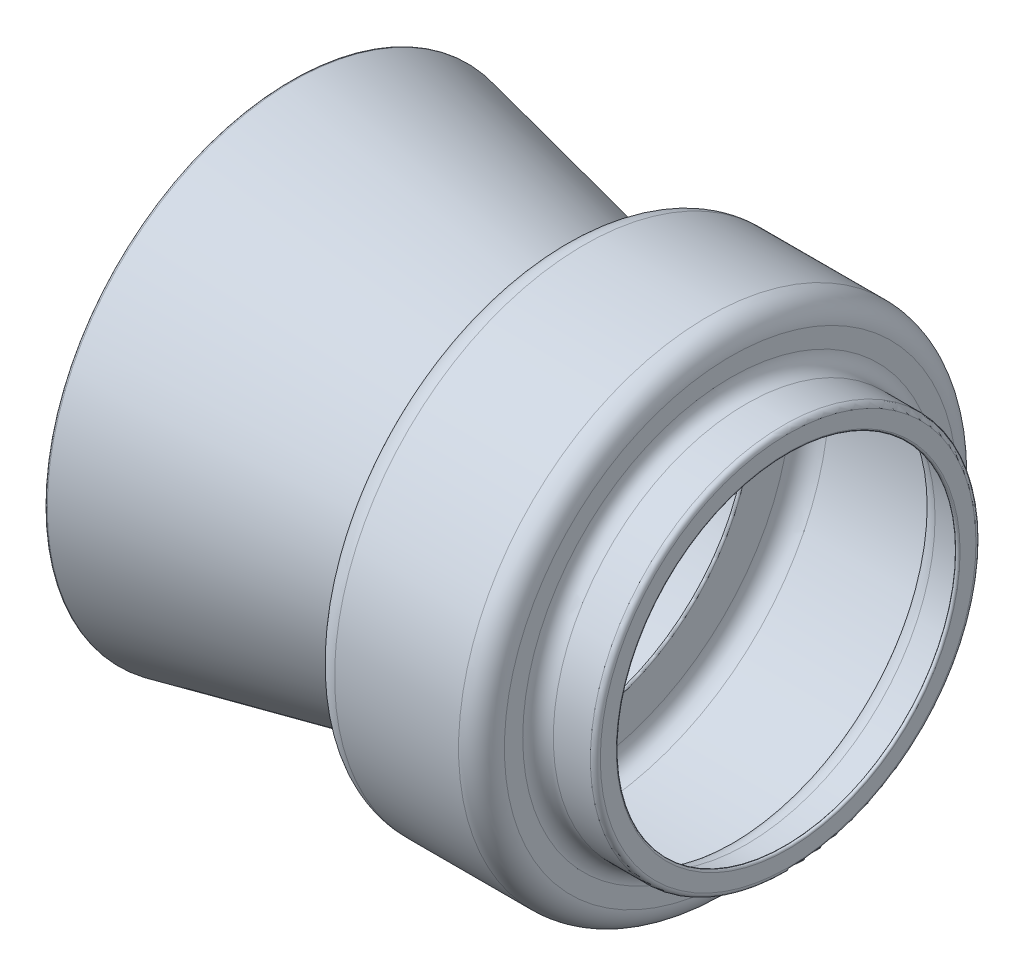
ISO-10303-21;
HEADER;
FILE_DESCRIPTION(('STEP AP214'),'2;1');
FILE_NAME('part.step','',(''),(''),'','','');
FILE_SCHEMA(('AUTOMOTIVE_DESIGN { 1 0 10303 214 1 1 1 1 }'));
ENDSEC;
DATA;
#1=APPLICATION_CONTEXT('core data for automotive mechanical design processes');
#2=APPLICATION_PROTOCOL_DEFINITION('international standard','automotive_design',2000,#1);
#3=PRODUCT_CONTEXT('',#1,'mechanical');
#4=PRODUCT('Part','Part','',(#3));
#5=PRODUCT_RELATED_PRODUCT_CATEGORY('part','',(#4));
#6=PRODUCT_DEFINITION_FORMATION('','',#4);
#7=PRODUCT_DEFINITION_CONTEXT('part definition',#1,'design');
#8=PRODUCT_DEFINITION('design','',#6,#7);
#9=PRODUCT_DEFINITION_SHAPE('','',#8);
#10=(LENGTH_UNIT() NAMED_UNIT(*) SI_UNIT(.MILLI.,.METRE.));
#11=(NAMED_UNIT(*) PLANE_ANGLE_UNIT() SI_UNIT($,.RADIAN.));
#12=(NAMED_UNIT(*) SI_UNIT($,.STERADIAN.) SOLID_ANGLE_UNIT());
#13=UNCERTAINTY_MEASURE_WITH_UNIT(LENGTH_MEASURE(1.E-05),#10,'distance_accuracy_value','');
#14=(GEOMETRIC_REPRESENTATION_CONTEXT(3) GLOBAL_UNCERTAINTY_ASSIGNED_CONTEXT((#13)) GLOBAL_UNIT_ASSIGNED_CONTEXT((#10,
#11,#12)) REPRESENTATION_CONTEXT('',''));
#15=CARTESIAN_POINT('',(0.,0.,0.));
#16=DIRECTION('',(0.,0.,1.));
#17=DIRECTION('',(1.,0.,0.));
#18=AXIS2_PLACEMENT_3D('',#15,#16,#17);
#19=CARTESIAN_POINT('',(403.522825001887,1.50496034846484E-13,7.14780592607678E-13));
#20=DIRECTION('',(1.,0.,0.));
#21=DIRECTION('',(0.,0.,-1.));
#22=AXIS2_PLACEMENT_3D('',#19,#20,#21);
#23=TOROIDAL_SURFACE('',#22,337.5,3.75000000000005);
#24=CARTESIAN_POINT('',(407.272825001887,1.50496034846484E-13,7.14780592607678E-13));
#25=DIRECTION('',(1.,0.,0.));
#26=DIRECTION('',(0.,0.,-1.));
#27=AXIS2_PLACEMENT_3D('',#24,#25,#26);
#28=CIRCLE('',#27,337.5);
#29=CARTESIAN_POINT('',(407.272825001887,1.50496034846484E-13,-337.499999999999));
#30=VERTEX_POINT('',#29);
#31=EDGE_CURVE('E10',#30,#30,#28,.T.);
#32=ORIENTED_EDGE('',*,*,#31,.T.);
#33=EDGE_LOOP('',(#32));
#34=FACE_BOUND('',#33,.T.);
#35=CARTESIAN_POINT('',(399.772825001887,1.50496034846484E-13,7.14780592607678E-13));
#36=DIRECTION('',(1.,0.,0.));
#37=DIRECTION('',(0.,0.,-1.));
#38=AXIS2_PLACEMENT_3D('',#35,#36,#37);
#39=CIRCLE('',#38,337.5);
#40=CARTESIAN_POINT('',(399.772825001887,1.50496034846484E-13,-337.499999999999));
#41=VERTEX_POINT('',#40);
#42=EDGE_CURVE('E105',#41,#41,#39,.T.);
#43=ORIENTED_EDGE('',*,*,#42,.F.);
#44=EDGE_LOOP('',(#43));
#45=FACE_BOUND('',#44,.T.);
#46=ADVANCED_FACE('F32',(#34,#45),#23,.T.);
#47=CARTESIAN_POINT('',(407.272825001887,337.5,7.14780592607678E-13));
#48=DIRECTION('',(1.,0.,0.));
#49=DIRECTION('',(0.,0.,-1.));
#50=AXIS2_PLACEMENT_3D('',#47,#48,#49);
#51=PLANE('',#50);
#52=CARTESIAN_POINT('',(407.272825001887,1.50496034846484E-13,7.14780592607678E-13));
#53=DIRECTION('',(1.,0.,0.));
#54=DIRECTION('',(0.,0.,-1.));
#55=AXIS2_PLACEMENT_3D('',#52,#53,#54);
#56=CIRCLE('',#55,368.625);
#57=CARTESIAN_POINT('',(407.272825001887,1.50496034846484E-13,-368.624999999999));
#58=VERTEX_POINT('',#57);
#59=EDGE_CURVE('E38',#58,#58,#56,.T.);
#60=ORIENTED_EDGE('',*,*,#59,.T.);
#61=EDGE_LOOP('',(#60));
#62=FACE_BOUND('',#61,.T.);
#63=ORIENTED_EDGE('',*,*,#31,.F.);
#64=EDGE_LOOP('',(#63));
#65=FACE_BOUND('',#64,.T.);
#66=ADVANCED_FACE('F113',(#62,#65),#51,.T.);
#67=CARTESIAN_POINT('',(397.522825001887,1.50496034846484E-13,7.14780592607678E-13));
#68=DIRECTION('',(1.,0.,0.));
#69=DIRECTION('',(0.,0.,-1.));
#70=AXIS2_PLACEMENT_3D('',#67,#68,#69);
#71=TOROIDAL_SURFACE('',#70,368.625,9.75000000000001);
#72=CARTESIAN_POINT('',(397.522825001887,1.50496034846484E-13,7.14780592607678E-13));
#73=DIRECTION('',(1.,0.,0.));
#74=DIRECTION('',(0.,0.,-1.));
#75=AXIS2_PLACEMENT_3D('',#72,#73,#74);
#76=CIRCLE('',#75,378.375);
#77=CARTESIAN_POINT('',(397.522825001887,1.50496034846484E-13,-378.374999999999));
#78=VERTEX_POINT('',#77);
#79=EDGE_CURVE('E42',#78,#78,#76,.T.);
#80=ORIENTED_EDGE('',*,*,#79,.T.);
#81=EDGE_LOOP('',(#80));
#82=FACE_BOUND('',#81,.T.);
#83=ORIENTED_EDGE('',*,*,#59,.F.);
#84=EDGE_LOOP('',(#83));
#85=FACE_BOUND('',#84,.T.);
#86=ADVANCED_FACE('F117',(#82,#85),#71,.T.);
#87=CARTESIAN_POINT('',(407.272825001887,1.50496034846484E-13,7.14780592607678E-13));
#88=DIRECTION('',(1.,0.,0.));
#89=DIRECTION('',(0.,0.,-1.));
#90=AXIS2_PLACEMENT_3D('',#87,#88,#89);
#91=CYLINDRICAL_SURFACE('',#90,378.375);
#92=CARTESIAN_POINT('',(324.772825001887,1.50496034846484E-13,7.14780592607678E-13));
#93=DIRECTION('',(1.,0.,0.));
#94=DIRECTION('',(0.,0.,-1.));
#95=AXIS2_PLACEMENT_3D('',#92,#93,#94);
#96=CIRCLE('',#95,378.375);
#97=CARTESIAN_POINT('',(324.772825001887,1.50496034846484E-13,-378.374999999999));
#98=VERTEX_POINT('',#97);
#99=EDGE_CURVE('E46',#98,#98,#96,.T.);
#100=ORIENTED_EDGE('',*,*,#99,.T.);
#101=EDGE_LOOP('',(#100));
#102=FACE_BOUND('',#101,.T.);
#103=ORIENTED_EDGE('',*,*,#79,.F.);
#104=EDGE_LOOP('',(#103));
#105=FACE_BOUND('',#104,.T.);
#106=ADVANCED_FACE('F121',(#102,#105),#91,.T.);
#107=CARTESIAN_POINT('',(324.772825001887,1.50496034846484E-13,7.14780592607678E-13));
#108=DIRECTION('',(1.,0.,0.));
#109=DIRECTION('',(0.,0.,-1.));
#110=AXIS2_PLACEMENT_3D('',#107,#108,#109);
#111=TOROIDAL_SURFACE('',#110,408.375,30.);
#112=CARTESIAN_POINT('',(294.772825001887,1.50496034846484E-13,7.14780592607678E-13));
#113=DIRECTION('',(1.,0.,0.));
#114=DIRECTION('',(0.,0.,-1.));
#115=AXIS2_PLACEMENT_3D('',#112,#113,#114);
#116=CIRCLE('',#115,408.375);
#117=CARTESIAN_POINT('',(294.772825001887,1.50496034846484E-13,-408.374999999999));
#118=VERTEX_POINT('',#117);
#119=EDGE_CURVE('E51',#118,#118,#116,.T.);
#120=ORIENTED_EDGE('',*,*,#119,.T.);
#121=EDGE_LOOP('',(#120));
#122=FACE_BOUND('',#121,.T.);
#123=ORIENTED_EDGE('',*,*,#99,.F.);
#124=EDGE_LOOP('',(#123));
#125=FACE_BOUND('',#124,.T.);
#126=ADVANCED_FACE('F128',(#122,#125),#111,.F.);
#127=CARTESIAN_POINT('',(294.772825001887,408.375,7.14780592607678E-13));
#128=DIRECTION('',(1.,0.,0.));
#129=DIRECTION('',(0.,0.,-1.));
#130=AXIS2_PLACEMENT_3D('',#127,#128,#129);
#131=PLANE('',#130);
#132=CARTESIAN_POINT('',(294.772825001887,1.50496034846484E-13,7.14780592607678E-13));
#133=DIRECTION('',(1.,0.,0.));
#134=DIRECTION('',(0.,0.,-1.));
#135=AXIS2_PLACEMENT_3D('',#132,#133,#134);
#136=CIRCLE('',#135,444.375);
#137=CARTESIAN_POINT('',(294.772825001887,1.50496034846484E-13,-444.374999999999));
#138=VERTEX_POINT('',#137);
#139=EDGE_CURVE('E54',#138,#138,#136,.T.);
#140=ORIENTED_EDGE('',*,*,#139,.T.);
#141=EDGE_LOOP('',(#140));
#142=FACE_BOUND('',#141,.T.);
#143=ORIENTED_EDGE('',*,*,#119,.F.);
#144=EDGE_LOOP('',(#143));
#145=FACE_BOUND('',#144,.T.);
#146=ADVANCED_FACE('F132',(#142,#145),#131,.T.);
#147=CARTESIAN_POINT('',(249.772825001887,1.50496034846484E-13,7.14780592607678E-13));
#148=DIRECTION('',(1.,0.,0.));
#149=DIRECTION('',(0.,0.,-1.));
#150=AXIS2_PLACEMENT_3D('',#147,#148,#149);
#151=TOROIDAL_SURFACE('',#150,444.375,45.);
#152=CARTESIAN_POINT('',(249.772825001887,1.50496034846484E-13,7.14780592607678E-13));
#153=DIRECTION('',(1.,0.,0.));
#154=DIRECTION('',(0.,0.,-1.));
#155=AXIS2_PLACEMENT_3D('',#152,#153,#154);
#156=CIRCLE('',#155,489.375);
#157=CARTESIAN_POINT('',(249.772825001887,1.50496034846484E-13,-489.374999999999));
#158=VERTEX_POINT('',#157);
#159=EDGE_CURVE('E57',#158,#158,#156,.T.);
#160=ORIENTED_EDGE('',*,*,#159,.T.);
#161=EDGE_LOOP('',(#160));
#162=FACE_BOUND('',#161,.T.);
#163=ORIENTED_EDGE('',*,*,#139,.F.);
#164=EDGE_LOOP('',(#163));
#165=FACE_BOUND('',#164,.T.);
#166=ADVANCED_FACE('F136',(#162,#165),#151,.T.);
#167=CARTESIAN_POINT('',(407.272825001887,1.50496034846484E-13,7.14780592607678E-13));
#168=DIRECTION('',(1.,0.,0.));
#169=DIRECTION('',(0.,0.,-1.));
#170=AXIS2_PLACEMENT_3D('',#167,#168,#169);
#171=CYLINDRICAL_SURFACE('',#170,489.375);
#172=CARTESIAN_POINT('',(6.4728250018873,1.50496034846484E-13,7.14780592607678E-13));
#173=DIRECTION('',(1.,0.,0.));
#174=DIRECTION('',(0.,0.,-1.));
#175=AXIS2_PLACEMENT_3D('',#172,#173,#174);
#176=CIRCLE('',#175,489.375);
#177=CARTESIAN_POINT('',(6.4728250018873,1.50496034846484E-13,-489.374999999999));
#178=VERTEX_POINT('',#177);
#179=EDGE_CURVE('E60',#178,#178,#176,.T.);
#180=ORIENTED_EDGE('',*,*,#179,.T.);
#181=EDGE_LOOP('',(#180));
#182=FACE_BOUND('',#181,.T.);
#183=ORIENTED_EDGE('',*,*,#159,.F.);
#184=EDGE_LOOP('',(#183));
#185=FACE_BOUND('',#184,.T.);
#186=ADVANCED_FACE('F140',(#182,#185),#171,.T.);
#187=CARTESIAN_POINT('',(6.4728250018873,1.50496034846484E-13,7.14780592607678E-13));
#188=DIRECTION('',(1.,0.,0.));
#189=DIRECTION('',(0.,0.,-1.));
#190=AXIS2_PLACEMENT_3D('',#187,#188,#189);
#191=TOROIDAL_SURFACE('',#190,444.375,45.);
#192=CARTESIAN_POINT('',(-38.5271749981127,1.50496034846484E-13,7.14780592607678E-13));
#193=DIRECTION('',(1.,0.,0.));
#194=DIRECTION('',(0.,0.,-1.));
#195=AXIS2_PLACEMENT_3D('',#192,#193,#194);
#196=CIRCLE('',#195,444.375);
#197=CARTESIAN_POINT('',(-38.5271749981127,1.50496034846484E-13,-444.374999999999));
#198=VERTEX_POINT('',#197);
#199=EDGE_CURVE('E63',#198,#198,#196,.T.);
#200=ORIENTED_EDGE('',*,*,#199,.T.);
#201=EDGE_LOOP('',(#200));
#202=FACE_BOUND('',#201,.T.);
#203=ORIENTED_EDGE('',*,*,#179,.F.);
#204=EDGE_LOOP('',(#203));
#205=FACE_BOUND('',#204,.T.);
#206=ADVANCED_FACE('F144',(#202,#205),#191,.T.);
#207=CARTESIAN_POINT('',(-38.5271749981127,444.375,7.14780592607678E-13));
#208=DIRECTION('',(-1.,0.,0.));
#209=DIRECTION('',(0.,0.,1.));
#210=AXIS2_PLACEMENT_3D('',#207,#208,#209);
#211=PLANE('',#210);
#212=CARTESIAN_POINT('',(-38.5271749981127,1.50496034846484E-13,7.14780592607678E-13));
#213=DIRECTION('',(1.,0.,0.));
#214=DIRECTION('',(0.,0.,-1.));
#215=AXIS2_PLACEMENT_3D('',#212,#213,#214);
#216=CIRCLE('',#215,371.775);
#217=CARTESIAN_POINT('',(-38.5271749981127,1.50496034846484E-13,-371.774999999999));
#218=VERTEX_POINT('',#217);
#219=EDGE_CURVE('E66',#218,#218,#216,.T.);
#220=ORIENTED_EDGE('',*,*,#219,.T.);
#221=EDGE_LOOP('',(#220));
#222=FACE_BOUND('',#221,.T.);
#223=ORIENTED_EDGE('',*,*,#199,.F.);
#224=EDGE_LOOP('',(#223));
#225=FACE_BOUND('',#224,.T.);
#226=ADVANCED_FACE('F148',(#222,#225),#211,.T.);
#227=CARTESIAN_POINT('',(-38.5271749981127,1.50496034846484E-13,7.14780592607678E-13));
#228=DIRECTION('',(-1.,0.,0.));
#229=DIRECTION('',(0.,0.,1.));
#230=AXIS2_PLACEMENT_3D('',#227,#228,#229);
#231=CONICAL_SURFACE('',#230,371.775,0.209439510239323);
#232=CARTESIAN_POINT('',(-563.527174998113,1.50496034846484E-13,7.14780592607678E-13));
#233=DIRECTION('',(1.,0.,0.));
#234=DIRECTION('',(0.,0.,-1.));
#235=AXIS2_PLACEMENT_3D('',#232,#233,#234);
#236=CIRCLE('',#235,483.367194876764);
#237=CARTESIAN_POINT('',(-563.527174998113,1.50496034846484E-13,-483.367194876763));
#238=VERTEX_POINT('',#237);
#239=EDGE_CURVE('E69',#238,#238,#236,.T.);
#240=ORIENTED_EDGE('',*,*,#239,.T.);
#241=EDGE_LOOP('',(#240));
#242=FACE_BOUND('',#241,.T.);
#243=ORIENTED_EDGE('',*,*,#219,.F.);
#244=EDGE_LOOP('',(#243));
#245=FACE_BOUND('',#244,.T.);
#246=ADVANCED_FACE('F152',(#242,#245),#231,.T.);
#247=CARTESIAN_POINT('',(-564.306843838679,1.50496034846484E-13,7.14780592607678E-13));
#248=DIRECTION('',(1.,0.,0.));
#249=DIRECTION('',(0.,0.,-1.));
#250=AXIS2_PLACEMENT_3D('',#247,#248,#249);
#251=TOROIDAL_SURFACE('',#250,479.699141374012,3.75000000000002);
#252=CARTESIAN_POINT('',(-565.086512679246,1.50496034846484E-13,7.14780592607678E-13));
#253=DIRECTION('',(1.,0.,0.));
#254=DIRECTION('',(0.,0.,-1.));
#255=AXIS2_PLACEMENT_3D('',#252,#253,#254);
#256=CIRCLE('',#255,476.03108787126);
#257=CARTESIAN_POINT('',(-565.086512679246,1.50496034846484E-13,-476.031087871259));
#258=VERTEX_POINT('',#257);
#259=EDGE_CURVE('E72',#258,#258,#256,.T.);
#260=ORIENTED_EDGE('',*,*,#259,.T.);
#261=EDGE_LOOP('',(#260));
#262=FACE_BOUND('',#261,.T.);
#263=ORIENTED_EDGE('',*,*,#239,.F.);
#264=EDGE_LOOP('',(#263));
#265=FACE_BOUND('',#264,.T.);
#266=ADVANCED_FACE('F156',(#262,#265),#251,.T.);
#267=CARTESIAN_POINT('',(-565.086512679246,1.50496034846484E-13,7.14780592607678E-13));
#268=DIRECTION('',(-1.,0.,0.));
#269=DIRECTION('',(0.,0.,1.));
#270=AXIS2_PLACEMENT_3D('',#267,#268,#269);
#271=CONICAL_SURFACE('',#270,476.03108787126,0.209439510239323);
#272=CARTESIAN_POINT('',(-35.5568438386793,1.50496034846484E-13,7.14780592607678E-13));
#273=DIRECTION('',(1.,0.,0.));
#274=DIRECTION('',(0.,0.,-1.));
#275=AXIS2_PLACEMENT_3D('',#272,#273,#274);
#276=CIRCLE('',#275,363.476082160242);
#277=CARTESIAN_POINT('',(-35.5568438386793,1.50496034846484E-13,-363.476082160241));
#278=VERTEX_POINT('',#277);
#279=EDGE_CURVE('E75',#278,#278,#276,.T.);
#280=ORIENTED_EDGE('',*,*,#279,.T.);
#281=EDGE_LOOP('',(#280));
#282=FACE_BOUND('',#281,.T.);
#283=ORIENTED_EDGE('',*,*,#259,.F.);
#284=EDGE_LOOP('',(#283));
#285=FACE_BOUND('',#284,.T.);
#286=ADVANCED_FACE('F160',(#282,#285),#271,.F.);
#287=CARTESIAN_POINT('',(-34.7771749981127,1.50496034846484E-13,7.14780592607678E-13));
#288=DIRECTION('',(1.,0.,0.));
#289=DIRECTION('',(0.,0.,-1.));
#290=AXIS2_PLACEMENT_3D('',#287,#288,#289);
#291=TOROIDAL_SURFACE('',#290,367.144135662994,3.75000000000001);
#292=CARTESIAN_POINT('',(-31.0271749981127,1.50496034846484E-13,7.14780592607678E-13));
#293=DIRECTION('',(1.,0.,0.));
#294=DIRECTION('',(0.,0.,-1.));
#295=AXIS2_PLACEMENT_3D('',#292,#293,#294);
#296=CIRCLE('',#295,367.144135662994);
#297=CARTESIAN_POINT('',(-31.0271749981127,1.50496034846484E-13,-367.144135662993));
#298=VERTEX_POINT('',#297);
#299=EDGE_CURVE('E78',#298,#298,#296,.T.);
#300=ORIENTED_EDGE('',*,*,#299,.T.);
#301=EDGE_LOOP('',(#300));
#302=FACE_BOUND('',#301,.T.);
#303=ORIENTED_EDGE('',*,*,#279,.F.);
#304=EDGE_LOOP('',(#303));
#305=FACE_BOUND('',#304,.T.);
#306=ADVANCED_FACE('F164',(#302,#305),#291,.T.);
#307=CARTESIAN_POINT('',(-31.0271749981127,444.375,7.14780592607678E-13));
#308=DIRECTION('',(1.,0.,0.));
#309=DIRECTION('',(0.,0.,-1.));
#310=AXIS2_PLACEMENT_3D('',#307,#308,#309);
#311=PLANE('',#310);
#312=CARTESIAN_POINT('',(-31.0271749981127,1.50496034846484E-13,7.14780592607678E-13));
#313=DIRECTION('',(1.,0.,0.));
#314=DIRECTION('',(0.,0.,-1.));
#315=AXIS2_PLACEMENT_3D('',#312,#313,#314);
#316=CIRCLE('',#315,444.375);
#317=CARTESIAN_POINT('',(-31.0271749981127,1.50496034846484E-13,-444.374999999999));
#318=VERTEX_POINT('',#317);
#319=EDGE_CURVE('E81',#318,#318,#316,.T.);
#320=ORIENTED_EDGE('',*,*,#319,.T.);
#321=EDGE_LOOP('',(#320));
#322=FACE_BOUND('',#321,.T.);
#323=ORIENTED_EDGE('',*,*,#299,.F.);
#324=EDGE_LOOP('',(#323));
#325=FACE_BOUND('',#324,.T.);
#326=ADVANCED_FACE('F168',(#322,#325),#311,.T.);
#327=CARTESIAN_POINT('',(6.4728250018873,1.50496034846484E-13,7.14780592607678E-13));
#328=DIRECTION('',(1.,0.,0.));
#329=DIRECTION('',(0.,0.,-1.));
#330=AXIS2_PLACEMENT_3D('',#327,#328,#329);
#331=TOROIDAL_SURFACE('',#330,444.375,37.5);
#332=CARTESIAN_POINT('',(6.4728250018873,1.50496034846484E-13,7.14780592607678E-13));
#333=DIRECTION('',(1.,0.,0.));
#334=DIRECTION('',(0.,0.,-1.));
#335=AXIS2_PLACEMENT_3D('',#332,#333,#334);
#336=CIRCLE('',#335,481.875);
#337=CARTESIAN_POINT('',(6.4728250018873,1.50496034846484E-13,-481.874999999999));
#338=VERTEX_POINT('',#337);
#339=EDGE_CURVE('E84',#338,#338,#336,.T.);
#340=ORIENTED_EDGE('',*,*,#339,.T.);
#341=EDGE_LOOP('',(#340));
#342=FACE_BOUND('',#341,.T.);
#343=ORIENTED_EDGE('',*,*,#319,.F.);
#344=EDGE_LOOP('',(#343));
#345=FACE_BOUND('',#344,.T.);
#346=ADVANCED_FACE('F172',(#342,#345),#331,.F.);
#347=CARTESIAN_POINT('',(407.272825001887,1.50496034846484E-13,7.14780592607678E-13));
#348=DIRECTION('',(1.,0.,0.));
#349=DIRECTION('',(0.,0.,-1.));
#350=AXIS2_PLACEMENT_3D('',#347,#348,#349);
#351=CYLINDRICAL_SURFACE('',#350,481.875);
#352=CARTESIAN_POINT('',(249.772825001887,1.50496034846484E-13,7.14780592607678E-13));
#353=DIRECTION('',(1.,0.,0.));
#354=DIRECTION('',(0.,0.,-1.));
#355=AXIS2_PLACEMENT_3D('',#352,#353,#354);
#356=CIRCLE('',#355,481.875);
#357=CARTESIAN_POINT('',(249.772825001887,1.50496034846484E-13,-481.874999999999));
#358=VERTEX_POINT('',#357);
#359=EDGE_CURVE('E87',#358,#358,#356,.T.);
#360=ORIENTED_EDGE('',*,*,#359,.T.);
#361=EDGE_LOOP('',(#360));
#362=FACE_BOUND('',#361,.T.);
#363=ORIENTED_EDGE('',*,*,#339,.F.);
#364=EDGE_LOOP('',(#363));
#365=FACE_BOUND('',#364,.T.);
#366=ADVANCED_FACE('F176',(#362,#365),#351,.F.);
#367=CARTESIAN_POINT('',(249.772825001887,1.50496034846484E-13,7.14780592607678E-13));
#368=DIRECTION('',(1.,0.,0.));
#369=DIRECTION('',(0.,0.,-1.));
#370=AXIS2_PLACEMENT_3D('',#367,#368,#369);
#371=TOROIDAL_SURFACE('',#370,444.375,37.5);
#372=CARTESIAN_POINT('',(287.272825001887,1.50496034846484E-13,7.14780592607678E-13));
#373=DIRECTION('',(1.,0.,0.));
#374=DIRECTION('',(0.,0.,-1.));
#375=AXIS2_PLACEMENT_3D('',#372,#373,#374);
#376=CIRCLE('',#375,444.375);
#377=CARTESIAN_POINT('',(287.272825001887,1.50496034846484E-13,-444.374999999999));
#378=VERTEX_POINT('',#377);
#379=EDGE_CURVE('E90',#378,#378,#376,.T.);
#380=ORIENTED_EDGE('',*,*,#379,.T.);
#381=EDGE_LOOP('',(#380));
#382=FACE_BOUND('',#381,.T.);
#383=ORIENTED_EDGE('',*,*,#359,.F.);
#384=EDGE_LOOP('',(#383));
#385=FACE_BOUND('',#384,.T.);
#386=ADVANCED_FACE('F180',(#382,#385),#371,.F.);
#387=CARTESIAN_POINT('',(287.272825001887,408.375,7.14780592607678E-13));
#388=DIRECTION('',(-1.,0.,0.));
#389=DIRECTION('',(0.,0.,1.));
#390=AXIS2_PLACEMENT_3D('',#387,#388,#389);
#391=PLANE('',#390);
#392=CARTESIAN_POINT('',(287.272825001887,1.50496034846484E-13,7.14780592607678E-13));
#393=DIRECTION('',(1.,0.,0.));
#394=DIRECTION('',(0.,0.,-1.));
#395=AXIS2_PLACEMENT_3D('',#392,#393,#394);
#396=CIRCLE('',#395,408.375);
#397=CARTESIAN_POINT('',(287.272825001887,1.50496034846484E-13,-408.374999999999));
#398=VERTEX_POINT('',#397);
#399=EDGE_CURVE('E93',#398,#398,#396,.T.);
#400=ORIENTED_EDGE('',*,*,#399,.T.);
#401=EDGE_LOOP('',(#400));
#402=FACE_BOUND('',#401,.T.);
#403=ORIENTED_EDGE('',*,*,#379,.F.);
#404=EDGE_LOOP('',(#403));
#405=FACE_BOUND('',#404,.T.);
#406=ADVANCED_FACE('F184',(#402,#405),#391,.T.);
#407=CARTESIAN_POINT('',(324.772825001887,1.50496034846484E-13,7.14780592607678E-13));
#408=DIRECTION('',(1.,0.,0.));
#409=DIRECTION('',(0.,0.,-1.));
#410=AXIS2_PLACEMENT_3D('',#407,#408,#409);
#411=TOROIDAL_SURFACE('',#410,408.375,37.5);
#412=CARTESIAN_POINT('',(324.772825001887,1.50496034846484E-13,7.14780592607678E-13));
#413=DIRECTION('',(1.,0.,0.));
#414=DIRECTION('',(0.,0.,-1.));
#415=AXIS2_PLACEMENT_3D('',#412,#413,#414);
#416=CIRCLE('',#415,370.875);
#417=CARTESIAN_POINT('',(324.772825001887,1.50496034846484E-13,-370.874999999999));
#418=VERTEX_POINT('',#417);
#419=EDGE_CURVE('E96',#418,#418,#416,.T.);
#420=ORIENTED_EDGE('',*,*,#419,.T.);
#421=EDGE_LOOP('',(#420));
#422=FACE_BOUND('',#421,.T.);
#423=ORIENTED_EDGE('',*,*,#399,.F.);
#424=EDGE_LOOP('',(#423));
#425=FACE_BOUND('',#424,.T.);
#426=ADVANCED_FACE('F188',(#422,#425),#411,.T.);
#427=CARTESIAN_POINT('',(407.272825001887,1.50496034846484E-13,7.14780592607678E-13));
#428=DIRECTION('',(1.,0.,0.));
#429=DIRECTION('',(0.,0.,-1.));
#430=AXIS2_PLACEMENT_3D('',#427,#428,#429);
#431=CYLINDRICAL_SURFACE('',#430,370.875);
#432=CARTESIAN_POINT('',(397.522825001887,1.50496034846484E-13,7.14780592607678E-13));
#433=DIRECTION('',(1.,0.,0.));
#434=DIRECTION('',(0.,0.,-1.));
#435=AXIS2_PLACEMENT_3D('',#432,#433,#434);
#436=CIRCLE('',#435,370.875);
#437=CARTESIAN_POINT('',(397.522825001887,1.50496034846484E-13,-370.874999999999));
#438=VERTEX_POINT('',#437);
#439=EDGE_CURVE('E99',#438,#438,#436,.T.);
#440=ORIENTED_EDGE('',*,*,#439,.T.);
#441=EDGE_LOOP('',(#440));
#442=FACE_BOUND('',#441,.T.);
#443=ORIENTED_EDGE('',*,*,#419,.F.);
#444=EDGE_LOOP('',(#443));
#445=FACE_BOUND('',#444,.T.);
#446=ADVANCED_FACE('F192',(#442,#445),#431,.F.);
#447=CARTESIAN_POINT('',(397.522825001887,1.50496034846484E-13,7.14780592607678E-13));
#448=DIRECTION('',(1.,0.,0.));
#449=DIRECTION('',(0.,0.,-1.));
#450=AXIS2_PLACEMENT_3D('',#447,#448,#449);
#451=TOROIDAL_SURFACE('',#450,368.625,2.25000000000001);
#452=CARTESIAN_POINT('',(399.772825001887,1.50496034846484E-13,7.14780592607678E-13));
#453=DIRECTION('',(1.,0.,0.));
#454=DIRECTION('',(0.,0.,-1.));
#455=AXIS2_PLACEMENT_3D('',#452,#453,#454);
#456=CIRCLE('',#455,368.625);
#457=CARTESIAN_POINT('',(399.772825001887,1.50496034846484E-13,-368.624999999999));
#458=VERTEX_POINT('',#457);
#459=EDGE_CURVE('E102',#458,#458,#456,.T.);
#460=ORIENTED_EDGE('',*,*,#459,.T.);
#461=EDGE_LOOP('',(#460));
#462=FACE_BOUND('',#461,.T.);
#463=ORIENTED_EDGE('',*,*,#439,.F.);
#464=EDGE_LOOP('',(#463));
#465=FACE_BOUND('',#464,.T.);
#466=ADVANCED_FACE('F196',(#462,#465),#451,.F.);
#467=CARTESIAN_POINT('',(399.772825001887,337.5,7.14780592607678E-13));
#468=DIRECTION('',(-1.,0.,0.));
#469=DIRECTION('',(0.,0.,1.));
#470=AXIS2_PLACEMENT_3D('',#467,#468,#469);
#471=PLANE('',#470);
#472=ORIENTED_EDGE('',*,*,#42,.T.);
#473=EDGE_LOOP('',(#472));
#474=FACE_BOUND('',#473,.T.);
#475=ORIENTED_EDGE('',*,*,#459,.F.);
#476=EDGE_LOOP('',(#475));
#477=FACE_BOUND('',#476,.T.);
#478=ADVANCED_FACE('F109',(#474,#477),#471,.T.);
#479=CLOSED_SHELL('',(#46,#66,#86,#106,#126,#146,#166,#186,#206,#226,#246,#266,#286,#306,#326,
#346,#366,#386,#406,#426,#446,#466,#478));
#480=MANIFOLD_SOLID_BREP('B2',#479);
#481=ADVANCED_BREP_SHAPE_REPRESENTATION('',(#18,#480),#14);
#482=SHAPE_DEFINITION_REPRESENTATION(#9,#481);
ENDSEC;
END-ISO-10303-21;
